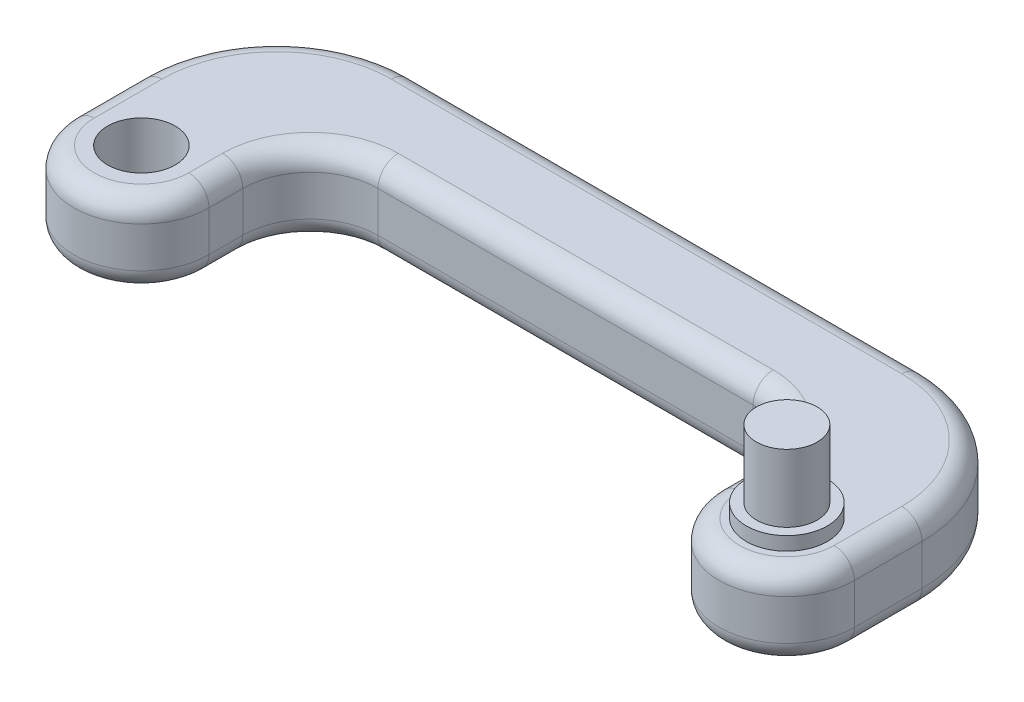
ISO-10303-21;
HEADER;
FILE_DESCRIPTION(('STEP AP214'),'2;1');
FILE_NAME('part.step','',(''),(''),'','','');
FILE_SCHEMA(('AUTOMOTIVE_DESIGN { 1 0 10303 214 1 1 1 1 }'));
ENDSEC;
DATA;
#1=APPLICATION_CONTEXT('core data for automotive mechanical design processes');
#2=APPLICATION_PROTOCOL_DEFINITION('international standard','automotive_design',2000,#1);
#3=PRODUCT_CONTEXT('',#1,'mechanical');
#4=PRODUCT('Part','Part','',(#3));
#5=PRODUCT_RELATED_PRODUCT_CATEGORY('part','',(#4));
#6=PRODUCT_DEFINITION_FORMATION('','',#4);
#7=PRODUCT_DEFINITION_CONTEXT('part definition',#1,'design');
#8=PRODUCT_DEFINITION('design','',#6,#7);
#9=PRODUCT_DEFINITION_SHAPE('','',#8);
#10=(LENGTH_UNIT() NAMED_UNIT(*) SI_UNIT(.MILLI.,.METRE.));
#11=(NAMED_UNIT(*) PLANE_ANGLE_UNIT() SI_UNIT($,.RADIAN.));
#12=(NAMED_UNIT(*) SI_UNIT($,.STERADIAN.) SOLID_ANGLE_UNIT());
#13=UNCERTAINTY_MEASURE_WITH_UNIT(LENGTH_MEASURE(1.E-05),#10,'distance_accuracy_value','');
#14=(GEOMETRIC_REPRESENTATION_CONTEXT(3) GLOBAL_UNCERTAINTY_ASSIGNED_CONTEXT((#13)) GLOBAL_UNIT_ASSIGNED_CONTEXT((#10,
#11,#12)) REPRESENTATION_CONTEXT('',''));
#15=CARTESIAN_POINT('',(0.,0.,0.));
#16=DIRECTION('',(0.,0.,1.));
#17=DIRECTION('',(1.,0.,0.));
#18=AXIS2_PLACEMENT_3D('',#15,#16,#17);
#19=CARTESIAN_POINT('',(-105.5,12.,0.));
#20=DIRECTION('',(-1.,0.,0.));
#21=DIRECTION('',(0.,0.,1.));
#22=AXIS2_PLACEMENT_3D('',#19,#20,#21);
#23=PLANE('',#22);
#24=DIRECTION('',(0.,-1.,0.));
#25=VECTOR('',#24,1.);
#26=CARTESIAN_POINT('',(-105.5,12.,0.));
#27=LINE('',#26,#25);
#28=CARTESIAN_POINT('',(-105.5,9.,0.));
#29=VERTEX_POINT('',#28);
#30=CARTESIAN_POINT('',(-105.5,3.,0.));
#31=VERTEX_POINT('',#30);
#32=EDGE_CURVE('E431',#29,#31,#27,.T.);
#33=ORIENTED_EDGE('',*,*,#32,.F.);
#34=DIRECTION('',(0.,0.,-1.));
#35=VECTOR('',#34,1.);
#36=CARTESIAN_POINT('',(-105.5,9.,0.));
#37=LINE('',#36,#35);
#38=CARTESIAN_POINT('',(-105.5,9.,-10.));
#39=VERTEX_POINT('',#38);
#40=EDGE_CURVE('E317',#29,#39,#37,.T.);
#41=ORIENTED_EDGE('',*,*,#40,.T.);
#42=DIRECTION('',(0.,-1.,0.));
#43=VECTOR('',#42,1.);
#44=CARTESIAN_POINT('',(-105.5,12.,-10.));
#45=LINE('',#44,#43);
#46=CARTESIAN_POINT('',(-105.5,3.,-10.));
#47=VERTEX_POINT('',#46);
#48=EDGE_CURVE('E239',#39,#47,#45,.T.);
#49=ORIENTED_EDGE('',*,*,#48,.T.);
#50=DIRECTION('',(0.,0.,-1.));
#51=VECTOR('',#50,1.);
#52=CARTESIAN_POINT('',(-105.5,3.,0.));
#53=LINE('',#52,#51);
#54=EDGE_CURVE('E314',#47,#31,#53,.F.);
#55=ORIENTED_EDGE('',*,*,#54,.T.);
#56=EDGE_LOOP('',(#33,#41,#49,#55));
#57=FACE_BOUND('',#56,.T.);
#58=ADVANCED_FACE('F37',(#57),#23,.T.);
#59=CARTESIAN_POINT('',(-95.5,12.,0.));
#60=DIRECTION('',(0.,-1.,0.));
#61=DIRECTION('',(0.,0.,-1.));
#62=AXIS2_PLACEMENT_3D('',#59,#60,#61);
#63=CYLINDRICAL_SURFACE('',#62,9.99999999999999);
#64=DIRECTION('',(0.,-1.,0.));
#65=VECTOR('',#64,1.);
#66=CARTESIAN_POINT('',(-85.5,12.,0.));
#67=LINE('',#66,#65);
#68=CARTESIAN_POINT('',(-85.5,9.,0.));
#69=VERTEX_POINT('',#68);
#70=CARTESIAN_POINT('',(-85.5,3.,0.));
#71=VERTEX_POINT('',#70);
#72=EDGE_CURVE('E427',#69,#71,#67,.T.);
#73=ORIENTED_EDGE('',*,*,#72,.F.);
#74=CARTESIAN_POINT('',(-95.5,9.,0.));
#75=DIRECTION('',(0.,1.,0.));
#76=DIRECTION('',(0.,0.,1.));
#77=AXIS2_PLACEMENT_3D('',#74,#75,#76);
#78=CIRCLE('',#77,9.99999999999999);
#79=EDGE_CURVE('E312',#69,#29,#78,.F.);
#80=ORIENTED_EDGE('',*,*,#79,.T.);
#81=ORIENTED_EDGE('',*,*,#32,.T.);
#82=CARTESIAN_POINT('',(-95.5,3.,0.));
#83=DIRECTION('',(0.,1.,0.));
#84=DIRECTION('',(0.,0.,1.));
#85=AXIS2_PLACEMENT_3D('',#82,#83,#84);
#86=CIRCLE('',#85,9.99999999999999);
#87=EDGE_CURVE('E310',#31,#71,#86,.T.);
#88=ORIENTED_EDGE('',*,*,#87,.T.);
#89=EDGE_LOOP('',(#73,#80,#81,#88));
#90=FACE_BOUND('',#89,.T.);
#91=ADVANCED_FACE('F474',(#90),#63,.T.);
#92=CARTESIAN_POINT('',(-85.5,12.,0.));
#93=DIRECTION('',(-1.,0.,0.));
#94=DIRECTION('',(0.,0.,1.));
#95=AXIS2_PLACEMENT_3D('',#92,#93,#94);
#96=PLANE('',#95);
#97=DIRECTION('',(0.,-1.,0.));
#98=VECTOR('',#97,1.);
#99=CARTESIAN_POINT('',(-85.5,12.,-5.));
#100=LINE('',#99,#98);
#101=CARTESIAN_POINT('',(-85.5,3.,-5.));
#102=VERTEX_POINT('',#101);
#103=CARTESIAN_POINT('',(-85.5,9.,-5.));
#104=VERTEX_POINT('',#103);
#105=EDGE_CURVE('E256',#102,#104,#100,.F.);
#106=ORIENTED_EDGE('',*,*,#105,.T.);
#107=DIRECTION('',(0.,0.,-1.));
#108=VECTOR('',#107,1.);
#109=CARTESIAN_POINT('',(-85.5,9.,0.));
#110=LINE('',#109,#108);
#111=EDGE_CURVE('E308',#104,#69,#110,.F.);
#112=ORIENTED_EDGE('',*,*,#111,.T.);
#113=ORIENTED_EDGE('',*,*,#72,.T.);
#114=DIRECTION('',(0.,0.,-1.));
#115=VECTOR('',#114,1.);
#116=CARTESIAN_POINT('',(-85.5,3.,0.));
#117=LINE('',#116,#115);
#118=EDGE_CURVE('E306',#71,#102,#117,.T.);
#119=ORIENTED_EDGE('',*,*,#118,.T.);
#120=EDGE_LOOP('',(#106,#112,#113,#119));
#121=FACE_BOUND('',#120,.T.);
#122=ADVANCED_FACE('F479',(#121),#96,.F.);
#123=CARTESIAN_POINT('',(0.,12.,-15.));
#124=DIRECTION('',(0.,0.,-1.));
#125=DIRECTION('',(-1.,0.,0.));
#126=AXIS2_PLACEMENT_3D('',#123,#124,#125);
#127=PLANE('',#126);
#128=DIRECTION('',(0.,-1.,0.));
#129=VECTOR('',#128,1.);
#130=CARTESIAN_POINT('',(-19.9999999999614,12.,-15.));
#131=LINE('',#130,#129);
#132=CARTESIAN_POINT('',(-19.9999999999614,3.,-15.));
#133=VERTEX_POINT('',#132);
#134=CARTESIAN_POINT('',(-19.9999999999614,9.,-15.));
#135=VERTEX_POINT('',#134);
#136=EDGE_CURVE('E253',#133,#135,#131,.F.);
#137=ORIENTED_EDGE('',*,*,#136,.T.);
#138=DIRECTION('',(1.,0.,0.));
#139=VECTOR('',#138,1.);
#140=CARTESIAN_POINT('',(-75.5,9.,-15.));
#141=LINE('',#140,#139);
#142=CARTESIAN_POINT('',(-75.5,9.,-15.));
#143=VERTEX_POINT('',#142);
#144=EDGE_CURVE('E300',#135,#143,#141,.F.);
#145=ORIENTED_EDGE('',*,*,#144,.T.);
#146=DIRECTION('',(0.,-1.,0.));
#147=VECTOR('',#146,1.);
#148=CARTESIAN_POINT('',(-75.5,0.,-15.));
#149=LINE('',#148,#147);
#150=CARTESIAN_POINT('',(-75.5,3.,-15.));
#151=VERTEX_POINT('',#150);
#152=EDGE_CURVE('E250',#143,#151,#149,.T.);
#153=ORIENTED_EDGE('',*,*,#152,.T.);
#154=DIRECTION('',(1.,0.,0.));
#155=VECTOR('',#154,1.);
#156=CARTESIAN_POINT('',(0.,3.,-15.));
#157=LINE('',#156,#155);
#158=EDGE_CURVE('E298',#151,#133,#157,.T.);
#159=ORIENTED_EDGE('',*,*,#158,.T.);
#160=EDGE_LOOP('',(#137,#145,#153,#159));
#161=FACE_BOUND('',#160,.T.);
#162=ADVANCED_FACE('F484',(#161),#127,.F.);
#163=CARTESIAN_POINT('',(-9.99999999996144,12.,0.));
#164=DIRECTION('',(-1.,0.,0.));
#165=DIRECTION('',(0.,0.,1.));
#166=AXIS2_PLACEMENT_3D('',#163,#164,#165);
#167=PLANE('',#166);
#168=DIRECTION('',(0.,-1.,0.));
#169=VECTOR('',#168,1.);
#170=CARTESIAN_POINT('',(-9.99999999996144,12.,0.));
#171=LINE('',#170,#169);
#172=CARTESIAN_POINT('',(-9.99999999996144,9.,0.));
#173=VERTEX_POINT('',#172);
#174=CARTESIAN_POINT('',(-9.99999999996144,3.,0.));
#175=VERTEX_POINT('',#174);
#176=EDGE_CURVE('E419',#173,#175,#171,.T.);
#177=ORIENTED_EDGE('',*,*,#176,.F.);
#178=DIRECTION('',(0.,0.,-1.));
#179=VECTOR('',#178,1.);
#180=CARTESIAN_POINT('',(-9.99999999996144,9.,0.));
#181=LINE('',#180,#179);
#182=CARTESIAN_POINT('',(-9.99999999996144,9.,-5.));
#183=VERTEX_POINT('',#182);
#184=EDGE_CURVE('E292',#173,#183,#181,.T.);
#185=ORIENTED_EDGE('',*,*,#184,.T.);
#186=DIRECTION('',(0.,-1.,0.));
#187=VECTOR('',#186,1.);
#188=CARTESIAN_POINT('',(-9.99999999996144,12.,-5.));
#189=LINE('',#188,#187);
#190=CARTESIAN_POINT('',(-9.99999999996144,3.,-5.));
#191=VERTEX_POINT('',#190);
#192=EDGE_CURVE('E247',#183,#191,#189,.T.);
#193=ORIENTED_EDGE('',*,*,#192,.T.);
#194=DIRECTION('',(0.,0.,-1.));
#195=VECTOR('',#194,1.);
#196=CARTESIAN_POINT('',(-9.99999999996144,3.,0.));
#197=LINE('',#196,#195);
#198=EDGE_CURVE('E290',#191,#175,#197,.F.);
#199=ORIENTED_EDGE('',*,*,#198,.T.);
#200=EDGE_LOOP('',(#177,#185,#193,#199));
#201=FACE_BOUND('',#200,.T.);
#202=ADVANCED_FACE('F418',(#201),#167,.T.);
#203=CARTESIAN_POINT('',(0.,12.,0.));
#204=DIRECTION('',(0.,-1.,0.));
#205=DIRECTION('',(0.,0.,-1.));
#206=AXIS2_PLACEMENT_3D('',#203,#204,#205);
#207=CYLINDRICAL_SURFACE('',#206,9.99999999996144);
#208=DIRECTION('',(0.,-1.,0.));
#209=VECTOR('',#208,1.);
#210=CARTESIAN_POINT('',(9.99999999996144,12.,0.));
#211=LINE('',#210,#209);
#212=CARTESIAN_POINT('',(9.99999999996144,9.,0.));
#213=VERTEX_POINT('',#212);
#214=CARTESIAN_POINT('',(9.99999999996144,3.,0.));
#215=VERTEX_POINT('',#214);
#216=EDGE_CURVE('E428',#213,#215,#211,.T.);
#217=ORIENTED_EDGE('',*,*,#216,.F.);
#218=CARTESIAN_POINT('',(0.,9.,0.));
#219=DIRECTION('',(0.,1.,0.));
#220=DIRECTION('',(0.,0.,1.));
#221=AXIS2_PLACEMENT_3D('',#218,#219,#220);
#222=CIRCLE('',#221,9.99999999996144);
#223=EDGE_CURVE('E288',#213,#173,#222,.F.);
#224=ORIENTED_EDGE('',*,*,#223,.T.);
#225=ORIENTED_EDGE('',*,*,#176,.T.);
#226=CARTESIAN_POINT('',(0.,3.,0.));
#227=DIRECTION('',(0.,1.,0.));
#228=DIRECTION('',(0.,0.,1.));
#229=AXIS2_PLACEMENT_3D('',#226,#227,#228);
#230=CIRCLE('',#229,9.99999999996144);
#231=EDGE_CURVE('E286',#175,#215,#230,.T.);
#232=ORIENTED_EDGE('',*,*,#231,.T.);
#233=EDGE_LOOP('',(#217,#224,#225,#232));
#234=FACE_BOUND('',#233,.T.);
#235=ADVANCED_FACE('F424',(#234),#207,.T.);
#236=CARTESIAN_POINT('',(9.99999999996144,12.,0.));
#237=DIRECTION('',(-1.,0.,0.));
#238=DIRECTION('',(0.,0.,1.));
#239=AXIS2_PLACEMENT_3D('',#236,#237,#238);
#240=PLANE('',#239);
#241=DIRECTION('',(0.,-1.,0.));
#242=VECTOR('',#241,1.);
#243=CARTESIAN_POINT('',(9.99999999996144,12.,-10.));
#244=LINE('',#243,#242);
#245=CARTESIAN_POINT('',(9.99999999996144,3.,-10.));
#246=VERTEX_POINT('',#245);
#247=CARTESIAN_POINT('',(9.99999999996144,9.,-10.));
#248=VERTEX_POINT('',#247);
#249=EDGE_CURVE('E237',#246,#248,#244,.F.);
#250=ORIENTED_EDGE('',*,*,#249,.T.);
#251=DIRECTION('',(0.,0.,-1.));
#252=VECTOR('',#251,1.);
#253=CARTESIAN_POINT('',(9.99999999996144,9.,0.));
#254=LINE('',#253,#252);
#255=EDGE_CURVE('E284',#248,#213,#254,.F.);
#256=ORIENTED_EDGE('',*,*,#255,.T.);
#257=ORIENTED_EDGE('',*,*,#216,.T.);
#258=DIRECTION('',(0.,0.,-1.));
#259=VECTOR('',#258,1.);
#260=CARTESIAN_POINT('',(9.99999999996144,3.,0.));
#261=LINE('',#260,#259);
#262=EDGE_CURVE('E220',#215,#246,#261,.T.);
#263=ORIENTED_EDGE('',*,*,#262,.T.);
#264=EDGE_LOOP('',(#250,#256,#257,#263));
#265=FACE_BOUND('',#264,.T.);
#266=ADVANCED_FACE('F460',(#265),#240,.F.);
#267=CARTESIAN_POINT('',(-95.5,12.,0.));
#268=DIRECTION('',(0.,-1.,0.));
#269=DIRECTION('',(0.,0.,-1.));
#270=AXIS2_PLACEMENT_3D('',#267,#268,#269);
#271=CYLINDRICAL_SURFACE('',#270,5.);
#272=CARTESIAN_POINT('',(-95.5,12.,0.));
#273=DIRECTION('',(0.,1.,0.));
#274=DIRECTION('',(0.,0.,1.));
#275=AXIS2_PLACEMENT_3D('',#272,#273,#274);
#276=CIRCLE('',#275,5.);
#277=CARTESIAN_POINT('',(-95.5,12.,5.00000000000002));
#278=VERTEX_POINT('',#277);
#279=EDGE_CURVE('E433',#278,#278,#276,.T.);
#280=ORIENTED_EDGE('',*,*,#279,.T.);
#281=EDGE_LOOP('',(#280));
#282=FACE_BOUND('',#281,.T.);
#283=CARTESIAN_POINT('',(-95.5,0.,0.));
#284=DIRECTION('',(0.,1.,0.));
#285=DIRECTION('',(0.,0.,1.));
#286=AXIS2_PLACEMENT_3D('',#283,#284,#285);
#287=CIRCLE('',#286,5.);
#288=CARTESIAN_POINT('',(-95.5,0.,5.00000000000002));
#289=VERTEX_POINT('',#288);
#290=EDGE_CURVE('E448',#289,#289,#287,.T.);
#291=ORIENTED_EDGE('',*,*,#290,.F.);
#292=EDGE_LOOP('',(#291));
#293=FACE_BOUND('',#292,.T.);
#294=ADVANCED_FACE('F458',(#282,#293),#271,.F.);
#295=CARTESIAN_POINT('',(0.,12.,-30.));
#296=DIRECTION('',(0.,0.,-1.));
#297=DIRECTION('',(-1.,0.,0.));
#298=AXIS2_PLACEMENT_3D('',#295,#296,#297);
#299=PLANE('',#298);
#300=DIRECTION('',(0.,-1.,0.));
#301=VECTOR('',#300,1.);
#302=CARTESIAN_POINT('',(-85.5,12.,-30.));
#303=LINE('',#302,#301);
#304=CARTESIAN_POINT('',(-85.5,3.,-30.));
#305=VERTEX_POINT('',#304);
#306=CARTESIAN_POINT('',(-85.5,9.,-30.));
#307=VERTEX_POINT('',#306);
#308=EDGE_CURVE('E230',#305,#307,#303,.F.);
#309=ORIENTED_EDGE('',*,*,#308,.T.);
#310=DIRECTION('',(1.,0.,0.));
#311=VECTOR('',#310,1.);
#312=CARTESIAN_POINT('',(0.,9.,-30.));
#313=LINE('',#312,#311);
#314=CARTESIAN_POINT('',(-10.0000000000386,9.,-30.));
#315=VERTEX_POINT('',#314);
#316=EDGE_CURVE('E204',#307,#315,#313,.T.);
#317=ORIENTED_EDGE('',*,*,#316,.T.);
#318=DIRECTION('',(0.,-1.,0.));
#319=VECTOR('',#318,1.);
#320=CARTESIAN_POINT('',(-10.0000000000386,0.,-30.));
#321=LINE('',#320,#319);
#322=CARTESIAN_POINT('',(-10.0000000000386,3.,-30.));
#323=VERTEX_POINT('',#322);
#324=EDGE_CURVE('E227',#315,#323,#321,.T.);
#325=ORIENTED_EDGE('',*,*,#324,.T.);
#326=DIRECTION('',(1.,0.,0.));
#327=VECTOR('',#326,1.);
#328=CARTESIAN_POINT('',(-85.5,3.,-30.));
#329=LINE('',#328,#327);
#330=EDGE_CURVE('E233',#323,#305,#329,.F.);
#331=ORIENTED_EDGE('',*,*,#330,.T.);
#332=EDGE_LOOP('',(#309,#317,#325,#331));
#333=FACE_BOUND('',#332,.T.);
#334=ADVANCED_FACE('F226',(#333),#299,.T.);
#335=CARTESIAN_POINT('',(0.,12.,0.));
#336=DIRECTION('',(0.,1.,0.));
#337=DIRECTION('',(0.,0.,1.));
#338=AXIS2_PLACEMENT_3D('',#335,#336,#337);
#339=PLANE('',#338);
#340=CARTESIAN_POINT('',(-10.0000000000386,12.,-10.));
#341=DIRECTION('',(0.,1.,0.));
#342=DIRECTION('',(0.,0.,1.));
#343=AXIS2_PLACEMENT_3D('',#340,#341,#342);
#344=CIRCLE('',#343,17.);
#345=CARTESIAN_POINT('',(6.99999999996144,12.,-10.));
#346=VERTEX_POINT('',#345);
#347=CARTESIAN_POINT('',(-10.0000000000386,12.,-27.));
#348=VERTEX_POINT('',#347);
#349=EDGE_CURVE('E279',#346,#348,#344,.T.);
#350=ORIENTED_EDGE('',*,*,#349,.T.);
#351=DIRECTION('',(1.,0.,0.));
#352=VECTOR('',#351,1.);
#353=CARTESIAN_POINT('',(0.,12.,-27.));
#354=LINE('',#353,#352);
#355=CARTESIAN_POINT('',(-85.5,12.,-27.));
#356=VERTEX_POINT('',#355);
#357=EDGE_CURVE('E206',#348,#356,#354,.F.);
#358=ORIENTED_EDGE('',*,*,#357,.T.);
#359=CARTESIAN_POINT('',(-85.5,12.,-10.));
#360=DIRECTION('',(0.,1.,0.));
#361=DIRECTION('',(0.,0.,1.));
#362=AXIS2_PLACEMENT_3D('',#359,#360,#361);
#363=CIRCLE('',#362,17.);
#364=CARTESIAN_POINT('',(-102.5,12.,-10.));
#365=VERTEX_POINT('',#364);
#366=EDGE_CURVE('E232',#356,#365,#363,.T.);
#367=ORIENTED_EDGE('',*,*,#366,.T.);
#368=DIRECTION('',(0.,0.,-1.));
#369=VECTOR('',#368,1.);
#370=CARTESIAN_POINT('',(-102.5,12.,0.));
#371=LINE('',#370,#369);
#372=CARTESIAN_POINT('',(-102.5,12.,0.));
#373=VERTEX_POINT('',#372);
#374=EDGE_CURVE('E261',#365,#373,#371,.F.);
#375=ORIENTED_EDGE('',*,*,#374,.T.);
#376=CARTESIAN_POINT('',(-95.5,12.,0.));
#377=DIRECTION('',(0.,1.,0.));
#378=DIRECTION('',(0.,0.,1.));
#379=AXIS2_PLACEMENT_3D('',#376,#377,#378);
#380=CIRCLE('',#379,6.99999999999999);
#381=CARTESIAN_POINT('',(-88.5,12.,0.));
#382=VERTEX_POINT('',#381);
#383=EDGE_CURVE('E263',#373,#382,#380,.T.);
#384=ORIENTED_EDGE('',*,*,#383,.T.);
#385=DIRECTION('',(0.,0.,-1.));
#386=VECTOR('',#385,1.);
#387=CARTESIAN_POINT('',(-88.5,12.,-5.));
#388=LINE('',#387,#386);
#389=CARTESIAN_POINT('',(-88.5,12.,-5.));
#390=VERTEX_POINT('',#389);
#391=EDGE_CURVE('E265',#382,#390,#388,.T.);
#392=ORIENTED_EDGE('',*,*,#391,.T.);
#393=CARTESIAN_POINT('',(-75.5,12.,-5.));
#394=DIRECTION('',(0.,1.,0.));
#395=DIRECTION('',(0.,0.,1.));
#396=AXIS2_PLACEMENT_3D('',#393,#394,#395);
#397=CIRCLE('',#396,13.);
#398=CARTESIAN_POINT('',(-75.5,12.,-18.));
#399=VERTEX_POINT('',#398);
#400=EDGE_CURVE('E267',#390,#399,#397,.F.);
#401=ORIENTED_EDGE('',*,*,#400,.T.);
#402=DIRECTION('',(1.,0.,0.));
#403=VECTOR('',#402,1.);
#404=CARTESIAN_POINT('',(-19.9999999999614,12.,-18.));
#405=LINE('',#404,#403);
#406=CARTESIAN_POINT('',(-19.9999999999614,12.,-18.));
#407=VERTEX_POINT('',#406);
#408=EDGE_CURVE('E269',#399,#407,#405,.T.);
#409=ORIENTED_EDGE('',*,*,#408,.T.);
#410=CARTESIAN_POINT('',(-19.9999999999614,12.,-5.));
#411=DIRECTION('',(0.,1.,0.));
#412=DIRECTION('',(0.,0.,1.));
#413=AXIS2_PLACEMENT_3D('',#410,#411,#412);
#414=CIRCLE('',#413,13.);
#415=CARTESIAN_POINT('',(-6.99999999996144,12.,-5.));
#416=VERTEX_POINT('',#415);
#417=EDGE_CURVE('E271',#407,#416,#414,.F.);
#418=ORIENTED_EDGE('',*,*,#417,.T.);
#419=DIRECTION('',(0.,0.,-1.));
#420=VECTOR('',#419,1.);
#421=CARTESIAN_POINT('',(-6.99999999996144,12.,0.));
#422=LINE('',#421,#420);
#423=CARTESIAN_POINT('',(-6.99999999996144,12.,0.));
#424=VERTEX_POINT('',#423);
#425=EDGE_CURVE('E273',#416,#424,#422,.F.);
#426=ORIENTED_EDGE('',*,*,#425,.T.);
#427=CARTESIAN_POINT('',(0.,12.,0.));
#428=DIRECTION('',(0.,1.,0.));
#429=DIRECTION('',(0.,0.,1.));
#430=AXIS2_PLACEMENT_3D('',#427,#428,#429);
#431=CIRCLE('',#430,6.99999999996144);
#432=CARTESIAN_POINT('',(6.99999999996144,12.,0.));
#433=VERTEX_POINT('',#432);
#434=EDGE_CURVE('E275',#424,#433,#431,.T.);
#435=ORIENTED_EDGE('',*,*,#434,.T.);
#436=DIRECTION('',(0.,0.,-1.));
#437=VECTOR('',#436,1.);
#438=CARTESIAN_POINT('',(6.99999999996144,12.,-10.));
#439=LINE('',#438,#437);
#440=EDGE_CURVE('E277',#433,#346,#439,.T.);
#441=ORIENTED_EDGE('',*,*,#440,.T.);
#442=EDGE_LOOP('',(#350,#358,#367,#375,#384,#392,#401,#409,#418,#426,#435,#441));
#443=FACE_BOUND('',#442,.T.);
#444=CARTESIAN_POINT('',(0.,12.,0.));
#445=DIRECTION('',(0.,1.,0.));
#446=DIRECTION('',(0.,0.,1.));
#447=AXIS2_PLACEMENT_3D('',#444,#445,#446);
#448=CIRCLE('',#447,6.);
#449=CARTESIAN_POINT('',(0.,12.,6.));
#450=VERTEX_POINT('',#449);
#451=EDGE_CURVE('E449',#450,#450,#448,.T.);
#452=ORIENTED_EDGE('',*,*,#451,.F.);
#453=EDGE_LOOP('',(#452));
#454=FACE_BOUND('',#453,.T.);
#455=ORIENTED_EDGE('',*,*,#279,.F.);
#456=EDGE_LOOP('',(#455));
#457=FACE_BOUND('',#456,.T.);
#458=ADVANCED_FACE('F467',(#443,#454,#457),#339,.T.);
#459=CARTESIAN_POINT('',(0.,0.,0.));
#460=DIRECTION('',(0.,1.,0.));
#461=DIRECTION('',(0.,0.,1.));
#462=AXIS2_PLACEMENT_3D('',#459,#460,#461);
#463=PLANE('',#462);
#464=CARTESIAN_POINT('',(-95.5,0.,0.));
#465=DIRECTION('',(0.,1.,0.));
#466=DIRECTION('',(0.,0.,1.));
#467=AXIS2_PLACEMENT_3D('',#464,#465,#466);
#468=CIRCLE('',#467,6.99999999999999);
#469=CARTESIAN_POINT('',(-88.5,0.,0.));
#470=VERTEX_POINT('',#469);
#471=CARTESIAN_POINT('',(-102.5,0.,0.));
#472=VERTEX_POINT('',#471);
#473=EDGE_CURVE('E54',#470,#472,#468,.F.);
#474=ORIENTED_EDGE('',*,*,#473,.T.);
#475=DIRECTION('',(0.,0.,-1.));
#476=VECTOR('',#475,1.);
#477=CARTESIAN_POINT('',(-102.5,0.,-10.));
#478=LINE('',#477,#476);
#479=CARTESIAN_POINT('',(-102.5,0.,-10.));
#480=VERTEX_POINT('',#479);
#481=EDGE_CURVE('E339',#472,#480,#478,.T.);
#482=ORIENTED_EDGE('',*,*,#481,.T.);
#483=CARTESIAN_POINT('',(-85.5,0.,-10.));
#484=DIRECTION('',(0.,1.,0.));
#485=DIRECTION('',(0.,0.,1.));
#486=AXIS2_PLACEMENT_3D('',#483,#484,#485);
#487=CIRCLE('',#486,17.);
#488=CARTESIAN_POINT('',(-85.5,0.,-27.));
#489=VERTEX_POINT('',#488);
#490=EDGE_CURVE('E319',#480,#489,#487,.F.);
#491=ORIENTED_EDGE('',*,*,#490,.T.);
#492=DIRECTION('',(1.,0.,0.));
#493=VECTOR('',#492,1.);
#494=CARTESIAN_POINT('',(-10.0000000000386,0.,-27.));
#495=LINE('',#494,#493);
#496=CARTESIAN_POINT('',(-10.0000000000386,0.,-27.));
#497=VERTEX_POINT('',#496);
#498=EDGE_CURVE('E321',#489,#497,#495,.T.);
#499=ORIENTED_EDGE('',*,*,#498,.T.);
#500=CARTESIAN_POINT('',(-10.0000000000386,0.,-10.));
#501=DIRECTION('',(0.,1.,0.));
#502=DIRECTION('',(0.,0.,1.));
#503=AXIS2_PLACEMENT_3D('',#500,#501,#502);
#504=CIRCLE('',#503,17.);
#505=CARTESIAN_POINT('',(6.99999999996144,0.,-10.));
#506=VERTEX_POINT('',#505);
#507=EDGE_CURVE('E323',#497,#506,#504,.F.);
#508=ORIENTED_EDGE('',*,*,#507,.T.);
#509=DIRECTION('',(0.,0.,-1.));
#510=VECTOR('',#509,1.);
#511=CARTESIAN_POINT('',(6.99999999996144,0.,0.));
#512=LINE('',#511,#510);
#513=CARTESIAN_POINT('',(6.99999999996144,0.,0.));
#514=VERTEX_POINT('',#513);
#515=EDGE_CURVE('E325',#506,#514,#512,.F.);
#516=ORIENTED_EDGE('',*,*,#515,.T.);
#517=CARTESIAN_POINT('',(0.,0.,0.));
#518=DIRECTION('',(0.,1.,0.));
#519=DIRECTION('',(0.,0.,1.));
#520=AXIS2_PLACEMENT_3D('',#517,#518,#519);
#521=CIRCLE('',#520,6.99999999996144);
#522=CARTESIAN_POINT('',(-6.99999999996144,0.,0.));
#523=VERTEX_POINT('',#522);
#524=EDGE_CURVE('E327',#514,#523,#521,.F.);
#525=ORIENTED_EDGE('',*,*,#524,.T.);
#526=DIRECTION('',(0.,0.,-1.));
#527=VECTOR('',#526,1.);
#528=CARTESIAN_POINT('',(-6.99999999996144,0.,-5.));
#529=LINE('',#528,#527);
#530=CARTESIAN_POINT('',(-6.99999999996144,0.,-5.));
#531=VERTEX_POINT('',#530);
#532=EDGE_CURVE('E329',#523,#531,#529,.T.);
#533=ORIENTED_EDGE('',*,*,#532,.T.);
#534=CARTESIAN_POINT('',(-19.9999999999614,0.,-5.));
#535=DIRECTION('',(0.,1.,0.));
#536=DIRECTION('',(0.,0.,1.));
#537=AXIS2_PLACEMENT_3D('',#534,#535,#536);
#538=CIRCLE('',#537,13.);
#539=CARTESIAN_POINT('',(-19.9999999999614,0.,-18.));
#540=VERTEX_POINT('',#539);
#541=EDGE_CURVE('E331',#531,#540,#538,.T.);
#542=ORIENTED_EDGE('',*,*,#541,.T.);
#543=DIRECTION('',(1.,0.,0.));
#544=VECTOR('',#543,1.);
#545=CARTESIAN_POINT('',(0.,0.,-18.));
#546=LINE('',#545,#544);
#547=CARTESIAN_POINT('',(-75.5,0.,-18.));
#548=VERTEX_POINT('',#547);
#549=EDGE_CURVE('E333',#540,#548,#546,.F.);
#550=ORIENTED_EDGE('',*,*,#549,.T.);
#551=CARTESIAN_POINT('',(-75.5,0.,-5.));
#552=DIRECTION('',(0.,1.,0.));
#553=DIRECTION('',(0.,0.,1.));
#554=AXIS2_PLACEMENT_3D('',#551,#552,#553);
#555=CIRCLE('',#554,13.);
#556=CARTESIAN_POINT('',(-88.5,0.,-5.));
#557=VERTEX_POINT('',#556);
#558=EDGE_CURVE('E335',#548,#557,#555,.T.);
#559=ORIENTED_EDGE('',*,*,#558,.T.);
#560=DIRECTION('',(0.,0.,-1.));
#561=VECTOR('',#560,1.);
#562=CARTESIAN_POINT('',(-88.5,0.,0.));
#563=LINE('',#562,#561);
#564=EDGE_CURVE('E59',#557,#470,#563,.F.);
#565=ORIENTED_EDGE('',*,*,#564,.T.);
#566=EDGE_LOOP('',(#474,#482,#491,#499,#508,#516,#525,#533,#542,#550,#559,#565));
#567=FACE_BOUND('',#566,.T.);
#568=ORIENTED_EDGE('',*,*,#290,.T.);
#569=EDGE_LOOP('',(#568));
#570=FACE_BOUND('',#569,.T.);
#571=ADVANCED_FACE('F456',(#567,#570),#463,.F.);
#572=CARTESIAN_POINT('',(0.,14.,0.));
#573=DIRECTION('',(0.,-1.,0.));
#574=DIRECTION('',(0.,0.,-1.));
#575=AXIS2_PLACEMENT_3D('',#572,#573,#574);
#576=CYLINDRICAL_SURFACE('',#575,6.);
#577=CARTESIAN_POINT('',(0.,14.,0.));
#578=DIRECTION('',(0.,1.,0.));
#579=DIRECTION('',(0.,0.,1.));
#580=AXIS2_PLACEMENT_3D('',#577,#578,#579);
#581=CIRCLE('',#580,6.);
#582=CARTESIAN_POINT('',(0.,14.,6.));
#583=VERTEX_POINT('',#582);
#584=EDGE_CURVE('E445',#583,#583,#581,.T.);
#585=ORIENTED_EDGE('',*,*,#584,.F.);
#586=EDGE_LOOP('',(#585));
#587=FACE_BOUND('',#586,.T.);
#588=ORIENTED_EDGE('',*,*,#451,.T.);
#589=EDGE_LOOP('',(#588));
#590=FACE_BOUND('',#589,.T.);
#591=ADVANCED_FACE('F495',(#587,#590),#576,.T.);
#592=CARTESIAN_POINT('',(0.,14.,0.));
#593=DIRECTION('',(0.,1.,0.));
#594=DIRECTION('',(0.,0.,1.));
#595=AXIS2_PLACEMENT_3D('',#592,#593,#594);
#596=PLANE('',#595);
#597=CARTESIAN_POINT('',(0.,14.,0.));
#598=DIRECTION('',(0.,1.,0.));
#599=DIRECTION('',(0.,0.,1.));
#600=AXIS2_PLACEMENT_3D('',#597,#598,#599);
#601=CIRCLE('',#600,4.5);
#602=CARTESIAN_POINT('',(0.,14.,4.5));
#603=VERTEX_POINT('',#602);
#604=EDGE_CURVE('E241',#603,#603,#601,.T.);
#605=ORIENTED_EDGE('',*,*,#604,.F.);
#606=EDGE_LOOP('',(#605));
#607=FACE_BOUND('',#606,.T.);
#608=ORIENTED_EDGE('',*,*,#584,.T.);
#609=EDGE_LOOP('',(#608));
#610=FACE_BOUND('',#609,.T.);
#611=ADVANCED_FACE('F501',(#607,#610),#596,.T.);
#612=CARTESIAN_POINT('',(0.,24.,0.));
#613=DIRECTION('',(0.,-1.,0.));
#614=DIRECTION('',(0.,0.,-1.));
#615=AXIS2_PLACEMENT_3D('',#612,#613,#614);
#616=CYLINDRICAL_SURFACE('',#615,4.5);
#617=CARTESIAN_POINT('',(0.,24.,0.));
#618=DIRECTION('',(0.,1.,0.));
#619=DIRECTION('',(0.,0.,1.));
#620=AXIS2_PLACEMENT_3D('',#617,#618,#619);
#621=CIRCLE('',#620,4.5);
#622=CARTESIAN_POINT('',(0.,24.,4.5));
#623=VERTEX_POINT('',#622);
#624=EDGE_CURVE('E371',#623,#623,#621,.T.);
#625=ORIENTED_EDGE('',*,*,#624,.F.);
#626=EDGE_LOOP('',(#625));
#627=FACE_BOUND('',#626,.T.);
#628=ORIENTED_EDGE('',*,*,#604,.T.);
#629=EDGE_LOOP('',(#628));
#630=FACE_BOUND('',#629,.T.);
#631=ADVANCED_FACE('F505',(#627,#630),#616,.T.);
#632=CARTESIAN_POINT('',(0.,24.,0.));
#633=DIRECTION('',(0.,1.,0.));
#634=DIRECTION('',(0.,0.,1.));
#635=AXIS2_PLACEMENT_3D('',#632,#633,#634);
#636=PLANE('',#635);
#637=ORIENTED_EDGE('',*,*,#624,.T.);
#638=EDGE_LOOP('',(#637));
#639=FACE_BOUND('',#638,.T.);
#640=ADVANCED_FACE('F509',(#639),#636,.T.);
#641=CARTESIAN_POINT('',(-10.0000000000386,12.,-10.));
#642=DIRECTION('',(0.,1.,0.));
#643=DIRECTION('',(0.,0.,1.));
#644=AXIS2_PLACEMENT_3D('',#641,#642,#643);
#645=CYLINDRICAL_SURFACE('',#644,20.);
#646=ORIENTED_EDGE('',*,*,#324,.F.);
#647=CARTESIAN_POINT('',(-10.0000000000386,9.,-10.));
#648=DIRECTION('',(0.,1.,0.));
#649=DIRECTION('',(0.,0.,1.));
#650=AXIS2_PLACEMENT_3D('',#647,#648,#649);
#651=CIRCLE('',#650,20.);
#652=EDGE_CURVE('E212',#315,#248,#651,.F.);
#653=ORIENTED_EDGE('',*,*,#652,.T.);
#654=ORIENTED_EDGE('',*,*,#249,.F.);
#655=CARTESIAN_POINT('',(-10.0000000000386,3.,-10.));
#656=DIRECTION('',(0.,1.,0.));
#657=DIRECTION('',(0.,0.,1.));
#658=AXIS2_PLACEMENT_3D('',#655,#656,#657);
#659=CIRCLE('',#658,20.);
#660=EDGE_CURVE('E221',#246,#323,#659,.T.);
#661=ORIENTED_EDGE('',*,*,#660,.T.);
#662=EDGE_LOOP('',(#646,#653,#654,#661));
#663=FACE_BOUND('',#662,.T.);
#664=ADVANCED_FACE('F235',(#663),#645,.T.);
#665=CARTESIAN_POINT('',(-85.5,12.,-10.));
#666=DIRECTION('',(0.,-1.,0.));
#667=DIRECTION('',(0.,0.,-1.));
#668=AXIS2_PLACEMENT_3D('',#665,#666,#667);
#669=CYLINDRICAL_SURFACE('',#668,20.);
#670=ORIENTED_EDGE('',*,*,#48,.F.);
#671=CARTESIAN_POINT('',(-85.5,9.,-10.));
#672=DIRECTION('',(0.,1.,0.));
#673=DIRECTION('',(0.,0.,1.));
#674=AXIS2_PLACEMENT_3D('',#671,#672,#673);
#675=CIRCLE('',#674,20.);
#676=EDGE_CURVE('E11',#39,#307,#675,.F.);
#677=ORIENTED_EDGE('',*,*,#676,.T.);
#678=ORIENTED_EDGE('',*,*,#308,.F.);
#679=CARTESIAN_POINT('',(-85.5,3.,-10.));
#680=DIRECTION('',(0.,1.,0.));
#681=DIRECTION('',(0.,0.,1.));
#682=AXIS2_PLACEMENT_3D('',#679,#680,#681);
#683=CIRCLE('',#682,20.);
#684=EDGE_CURVE('E46',#305,#47,#683,.T.);
#685=ORIENTED_EDGE('',*,*,#684,.T.);
#686=EDGE_LOOP('',(#670,#677,#678,#685));
#687=FACE_BOUND('',#686,.T.);
#688=ADVANCED_FACE('F516',(#687),#669,.T.);
#689=CARTESIAN_POINT('',(-19.9999999999614,12.,-5.));
#690=DIRECTION('',(0.,-1.,0.));
#691=DIRECTION('',(0.,0.,-1.));
#692=AXIS2_PLACEMENT_3D('',#689,#690,#691);
#693=CYLINDRICAL_SURFACE('',#692,10.);
#694=ORIENTED_EDGE('',*,*,#192,.F.);
#695=CARTESIAN_POINT('',(-19.9999999999614,9.,-5.));
#696=DIRECTION('',(0.,1.,0.));
#697=DIRECTION('',(0.,0.,1.));
#698=AXIS2_PLACEMENT_3D('',#695,#696,#697);
#699=CIRCLE('',#698,10.);
#700=EDGE_CURVE('E296',#183,#135,#699,.T.);
#701=ORIENTED_EDGE('',*,*,#700,.T.);
#702=ORIENTED_EDGE('',*,*,#136,.F.);
#703=CARTESIAN_POINT('',(-19.9999999999614,3.,-5.));
#704=DIRECTION('',(0.,1.,0.));
#705=DIRECTION('',(0.,0.,1.));
#706=AXIS2_PLACEMENT_3D('',#703,#704,#705);
#707=CIRCLE('',#706,10.);
#708=EDGE_CURVE('E294',#133,#191,#707,.F.);
#709=ORIENTED_EDGE('',*,*,#708,.T.);
#710=EDGE_LOOP('',(#694,#701,#702,#709));
#711=FACE_BOUND('',#710,.T.);
#712=ADVANCED_FACE('F522',(#711),#693,.F.);
#713=CARTESIAN_POINT('',(-75.5,12.,-5.));
#714=DIRECTION('',(0.,1.,0.));
#715=DIRECTION('',(0.,0.,1.));
#716=AXIS2_PLACEMENT_3D('',#713,#714,#715);
#717=CYLINDRICAL_SURFACE('',#716,10.);
#718=ORIENTED_EDGE('',*,*,#152,.F.);
#719=CARTESIAN_POINT('',(-75.5,9.,-5.));
#720=DIRECTION('',(0.,1.,0.));
#721=DIRECTION('',(0.,0.,1.));
#722=AXIS2_PLACEMENT_3D('',#719,#720,#721);
#723=CIRCLE('',#722,10.);
#724=EDGE_CURVE('E304',#143,#104,#723,.T.);
#725=ORIENTED_EDGE('',*,*,#724,.T.);
#726=ORIENTED_EDGE('',*,*,#105,.F.);
#727=CARTESIAN_POINT('',(-75.5,3.,-5.));
#728=DIRECTION('',(0.,1.,0.));
#729=DIRECTION('',(0.,0.,1.));
#730=AXIS2_PLACEMENT_3D('',#727,#728,#729);
#731=CIRCLE('',#730,10.);
#732=EDGE_CURVE('E302',#102,#151,#731,.F.);
#733=ORIENTED_EDGE('',*,*,#732,.T.);
#734=EDGE_LOOP('',(#718,#725,#726,#733));
#735=FACE_BOUND('',#734,.T.);
#736=ADVANCED_FACE('F528',(#735),#717,.F.);
#737=CARTESIAN_POINT('',(0.,9.,-18.));
#738=DIRECTION('',(-1.,0.,0.));
#739=DIRECTION('',(0.,0.,1.));
#740=AXIS2_PLACEMENT_3D('',#737,#738,#739);
#741=CYLINDRICAL_SURFACE('',#740,3.);
#742=CARTESIAN_POINT('',(-19.9999999999614,9.,-18.));
#743=DIRECTION('',(1.,0.,0.));
#744=DIRECTION('',(0.,0.,-1.));
#745=AXIS2_PLACEMENT_3D('',#742,#743,#744);
#746=CIRCLE('',#745,3.);
#747=EDGE_CURVE('E365',#407,#135,#746,.T.);
#748=ORIENTED_EDGE('',*,*,#747,.F.);
#749=ORIENTED_EDGE('',*,*,#408,.F.);
#750=CARTESIAN_POINT('',(-75.5,9.,-18.));
#751=DIRECTION('',(-1.,0.,0.));
#752=DIRECTION('',(0.,0.,1.));
#753=AXIS2_PLACEMENT_3D('',#750,#751,#752);
#754=CIRCLE('',#753,3.);
#755=EDGE_CURVE('E368',#143,#399,#754,.T.);
#756=ORIENTED_EDGE('',*,*,#755,.F.);
#757=ORIENTED_EDGE('',*,*,#144,.F.);
#758=EDGE_LOOP('',(#748,#749,#756,#757));
#759=FACE_BOUND('',#758,.T.);
#760=ADVANCED_FACE('F532',(#759),#741,.T.);
#761=CARTESIAN_POINT('',(-75.5,9.,-5.));
#762=DIRECTION('',(0.,1.,0.));
#763=DIRECTION('',(0.,0.,1.));
#764=AXIS2_PLACEMENT_3D('',#761,#762,#763);
#765=TOROIDAL_SURFACE('',#764,13.,3.);
#766=ORIENTED_EDGE('',*,*,#755,.T.);
#767=ORIENTED_EDGE('',*,*,#400,.F.);
#768=CARTESIAN_POINT('',(-88.5,9.,-5.));
#769=DIRECTION('',(0.,0.,1.));
#770=DIRECTION('',(1.,0.,0.));
#771=AXIS2_PLACEMENT_3D('',#768,#769,#770);
#772=CIRCLE('',#771,3.);
#773=EDGE_CURVE('E362',#104,#390,#772,.T.);
#774=ORIENTED_EDGE('',*,*,#773,.F.);
#775=ORIENTED_EDGE('',*,*,#724,.F.);
#776=EDGE_LOOP('',(#766,#767,#774,#775));
#777=FACE_BOUND('',#776,.T.);
#778=ADVANCED_FACE('F569',(#777),#765,.T.);
#779=CARTESIAN_POINT('',(-19.9999999999614,9.,-5.));
#780=DIRECTION('',(0.,1.,0.));
#781=DIRECTION('',(0.,0.,1.));
#782=AXIS2_PLACEMENT_3D('',#779,#780,#781);
#783=TOROIDAL_SURFACE('',#782,13.,3.);
#784=ORIENTED_EDGE('',*,*,#747,.T.);
#785=ORIENTED_EDGE('',*,*,#700,.F.);
#786=CARTESIAN_POINT('',(-6.99999999996144,9.,-5.));
#787=DIRECTION('',(0.,0.,1.));
#788=DIRECTION('',(1.,0.,0.));
#789=AXIS2_PLACEMENT_3D('',#786,#787,#788);
#790=CIRCLE('',#789,3.);
#791=EDGE_CURVE('E359',#416,#183,#790,.T.);
#792=ORIENTED_EDGE('',*,*,#791,.F.);
#793=ORIENTED_EDGE('',*,*,#417,.F.);
#794=EDGE_LOOP('',(#784,#785,#792,#793));
#795=FACE_BOUND('',#794,.T.);
#796=ADVANCED_FACE('F565',(#795),#783,.T.);
#797=CARTESIAN_POINT('',(-88.5,9.,0.));
#798=DIRECTION('',(0.,0.,1.));
#799=DIRECTION('',(1.,0.,0.));
#800=AXIS2_PLACEMENT_3D('',#797,#798,#799);
#801=CYLINDRICAL_SURFACE('',#800,3.);
#802=ORIENTED_EDGE('',*,*,#773,.T.);
#803=ORIENTED_EDGE('',*,*,#391,.F.);
#804=CARTESIAN_POINT('',(-88.5,9.,0.));
#805=DIRECTION('',(0.,0.,1.));
#806=DIRECTION('',(1.,0.,0.));
#807=AXIS2_PLACEMENT_3D('',#804,#805,#806);
#808=CIRCLE('',#807,3.);
#809=EDGE_CURVE('E356',#69,#382,#808,.T.);
#810=ORIENTED_EDGE('',*,*,#809,.F.);
#811=ORIENTED_EDGE('',*,*,#111,.F.);
#812=EDGE_LOOP('',(#802,#803,#810,#811));
#813=FACE_BOUND('',#812,.T.);
#814=ADVANCED_FACE('F561',(#813),#801,.T.);
#815=CARTESIAN_POINT('',(-6.99999999996144,9.,0.));
#816=DIRECTION('',(0.,0.,-1.));
#817=DIRECTION('',(-1.,0.,0.));
#818=AXIS2_PLACEMENT_3D('',#815,#816,#817);
#819=CYLINDRICAL_SURFACE('',#818,3.);
#820=ORIENTED_EDGE('',*,*,#791,.T.);
#821=ORIENTED_EDGE('',*,*,#184,.F.);
#822=CARTESIAN_POINT('',(-6.99999999996144,9.,0.));
#823=DIRECTION('',(0.,0.,1.));
#824=DIRECTION('',(1.,0.,0.));
#825=AXIS2_PLACEMENT_3D('',#822,#823,#824);
#826=CIRCLE('',#825,3.);
#827=EDGE_CURVE('E353',#424,#173,#826,.T.);
#828=ORIENTED_EDGE('',*,*,#827,.F.);
#829=ORIENTED_EDGE('',*,*,#425,.F.);
#830=EDGE_LOOP('',(#820,#821,#828,#829));
#831=FACE_BOUND('',#830,.T.);
#832=ADVANCED_FACE('F557',(#831),#819,.T.);
#833=CARTESIAN_POINT('',(-95.5,9.,0.));
#834=DIRECTION('',(0.,1.,0.));
#835=DIRECTION('',(0.,0.,1.));
#836=AXIS2_PLACEMENT_3D('',#833,#834,#835);
#837=TOROIDAL_SURFACE('',#836,6.99999999999999,3.);
#838=ORIENTED_EDGE('',*,*,#809,.T.);
#839=ORIENTED_EDGE('',*,*,#383,.F.);
#840=CARTESIAN_POINT('',(-102.5,9.,0.));
#841=DIRECTION('',(0.,0.,-1.));
#842=DIRECTION('',(-1.,0.,0.));
#843=AXIS2_PLACEMENT_3D('',#840,#841,#842);
#844=CIRCLE('',#843,3.);
#845=EDGE_CURVE('E350',#29,#373,#844,.T.);
#846=ORIENTED_EDGE('',*,*,#845,.F.);
#847=ORIENTED_EDGE('',*,*,#79,.F.);
#848=EDGE_LOOP('',(#838,#839,#846,#847));
#849=FACE_BOUND('',#848,.T.);
#850=ADVANCED_FACE('F553',(#849),#837,.T.);
#851=CARTESIAN_POINT('',(0.,9.,0.));
#852=DIRECTION('',(0.,1.,0.));
#853=DIRECTION('',(0.,0.,1.));
#854=AXIS2_PLACEMENT_3D('',#851,#852,#853);
#855=TOROIDAL_SURFACE('',#854,6.99999999996144,3.);
#856=ORIENTED_EDGE('',*,*,#827,.T.);
#857=ORIENTED_EDGE('',*,*,#223,.F.);
#858=CARTESIAN_POINT('',(6.99999999996144,9.,0.));
#859=DIRECTION('',(0.,0.,-1.));
#860=DIRECTION('',(-1.,0.,0.));
#861=AXIS2_PLACEMENT_3D('',#858,#859,#860);
#862=CIRCLE('',#861,3.);
#863=EDGE_CURVE('E347',#433,#213,#862,.T.);
#864=ORIENTED_EDGE('',*,*,#863,.F.);
#865=ORIENTED_EDGE('',*,*,#434,.F.);
#866=EDGE_LOOP('',(#856,#857,#864,#865));
#867=FACE_BOUND('',#866,.T.);
#868=ADVANCED_FACE('F549',(#867),#855,.T.);
#869=CARTESIAN_POINT('',(-102.5,9.,0.));
#870=DIRECTION('',(0.,0.,-1.));
#871=DIRECTION('',(-1.,0.,0.));
#872=AXIS2_PLACEMENT_3D('',#869,#870,#871);
#873=CYLINDRICAL_SURFACE('',#872,3.);
#874=ORIENTED_EDGE('',*,*,#845,.T.);
#875=ORIENTED_EDGE('',*,*,#374,.F.);
#876=CARTESIAN_POINT('',(-102.5,9.,-10.));
#877=DIRECTION('',(0.,0.,-1.));
#878=DIRECTION('',(-1.,0.,0.));
#879=AXIS2_PLACEMENT_3D('',#876,#877,#878);
#880=CIRCLE('',#879,3.);
#881=EDGE_CURVE('E344',#39,#365,#880,.T.);
#882=ORIENTED_EDGE('',*,*,#881,.F.);
#883=ORIENTED_EDGE('',*,*,#40,.F.);
#884=EDGE_LOOP('',(#874,#875,#882,#883));
#885=FACE_BOUND('',#884,.T.);
#886=ADVANCED_FACE('F545',(#885),#873,.T.);
#887=CARTESIAN_POINT('',(6.99999999996144,9.,0.));
#888=DIRECTION('',(0.,0.,1.));
#889=DIRECTION('',(1.,0.,0.));
#890=AXIS2_PLACEMENT_3D('',#887,#888,#889);
#891=CYLINDRICAL_SURFACE('',#890,3.);
#892=ORIENTED_EDGE('',*,*,#863,.T.);
#893=ORIENTED_EDGE('',*,*,#255,.F.);
#894=CARTESIAN_POINT('',(6.99999999996144,9.,-10.));
#895=DIRECTION('',(0.,0.,-1.));
#896=DIRECTION('',(-1.,0.,0.));
#897=AXIS2_PLACEMENT_3D('',#894,#895,#896);
#898=CIRCLE('',#897,3.);
#899=EDGE_CURVE('E215',#346,#248,#898,.T.);
#900=ORIENTED_EDGE('',*,*,#899,.F.);
#901=ORIENTED_EDGE('',*,*,#440,.F.);
#902=EDGE_LOOP('',(#892,#893,#900,#901));
#903=FACE_BOUND('',#902,.T.);
#904=ADVANCED_FACE('F541',(#903),#891,.T.);
#905=CARTESIAN_POINT('',(-85.5,9.,-10.));
#906=DIRECTION('',(0.,1.,0.));
#907=DIRECTION('',(0.,0.,1.));
#908=AXIS2_PLACEMENT_3D('',#905,#906,#907);
#909=TOROIDAL_SURFACE('',#908,17.,3.);
#910=ORIENTED_EDGE('',*,*,#881,.T.);
#911=ORIENTED_EDGE('',*,*,#366,.F.);
#912=CARTESIAN_POINT('',(-85.5,9.,-27.));
#913=DIRECTION('',(1.,0.,0.));
#914=DIRECTION('',(0.,0.,-1.));
#915=AXIS2_PLACEMENT_3D('',#912,#913,#914);
#916=CIRCLE('',#915,3.);
#917=EDGE_CURVE('E209',#307,#356,#916,.T.);
#918=ORIENTED_EDGE('',*,*,#917,.F.);
#919=ORIENTED_EDGE('',*,*,#676,.F.);
#920=EDGE_LOOP('',(#910,#911,#918,#919));
#921=FACE_BOUND('',#920,.T.);
#922=ADVANCED_FACE('F538',(#921),#909,.T.);
#923=CARTESIAN_POINT('',(-10.0000000000386,9.,-10.));
#924=DIRECTION('',(0.,1.,0.));
#925=DIRECTION('',(0.,0.,1.));
#926=AXIS2_PLACEMENT_3D('',#923,#924,#925);
#927=TOROIDAL_SURFACE('',#926,17.,3.);
#928=ORIENTED_EDGE('',*,*,#899,.T.);
#929=ORIENTED_EDGE('',*,*,#652,.F.);
#930=CARTESIAN_POINT('',(-10.0000000000386,9.,-27.));
#931=DIRECTION('',(-1.,0.,0.));
#932=DIRECTION('',(0.,0.,1.));
#933=AXIS2_PLACEMENT_3D('',#930,#931,#932);
#934=CIRCLE('',#933,3.);
#935=EDGE_CURVE('E200',#348,#315,#934,.T.);
#936=ORIENTED_EDGE('',*,*,#935,.F.);
#937=ORIENTED_EDGE('',*,*,#349,.F.);
#938=EDGE_LOOP('',(#928,#929,#936,#937));
#939=FACE_BOUND('',#938,.T.);
#940=ADVANCED_FACE('F213',(#939),#927,.T.);
#941=CARTESIAN_POINT('',(0.,9.,-27.));
#942=DIRECTION('',(1.,0.,0.));
#943=DIRECTION('',(0.,0.,-1.));
#944=AXIS2_PLACEMENT_3D('',#941,#942,#943);
#945=CYLINDRICAL_SURFACE('',#944,3.);
#946=ORIENTED_EDGE('',*,*,#917,.T.);
#947=ORIENTED_EDGE('',*,*,#357,.F.);
#948=ORIENTED_EDGE('',*,*,#935,.T.);
#949=ORIENTED_EDGE('',*,*,#316,.F.);
#950=EDGE_LOOP('',(#946,#947,#948,#949));
#951=FACE_BOUND('',#950,.T.);
#952=ADVANCED_FACE('F202',(#951),#945,.T.);
#953=CARTESIAN_POINT('',(-6.99999999996144,3.,0.));
#954=DIRECTION('',(0.,0.,1.));
#955=DIRECTION('',(1.,0.,0.));
#956=AXIS2_PLACEMENT_3D('',#953,#954,#955);
#957=CYLINDRICAL_SURFACE('',#956,3.);
#958=CARTESIAN_POINT('',(-6.99999999996144,3.,0.));
#959=DIRECTION('',(0.,0.,1.));
#960=DIRECTION('',(1.,0.,0.));
#961=AXIS2_PLACEMENT_3D('',#958,#959,#960);
#962=CIRCLE('',#961,3.);
#963=EDGE_CURVE('E399',#175,#523,#962,.T.);
#964=ORIENTED_EDGE('',*,*,#963,.F.);
#965=ORIENTED_EDGE('',*,*,#198,.F.);
#966=CARTESIAN_POINT('',(-6.99999999996144,3.,-5.));
#967=DIRECTION('',(0.,0.,-1.));
#968=DIRECTION('',(-1.,0.,0.));
#969=AXIS2_PLACEMENT_3D('',#966,#967,#968);
#970=CIRCLE('',#969,3.);
#971=EDGE_CURVE('E41',#531,#191,#970,.T.);
#972=ORIENTED_EDGE('',*,*,#971,.F.);
#973=ORIENTED_EDGE('',*,*,#532,.F.);
#974=EDGE_LOOP('',(#964,#965,#972,#973));
#975=FACE_BOUND('',#974,.T.);
#976=ADVANCED_FACE('F39',(#975),#957,.T.);
#977=CARTESIAN_POINT('',(-19.9999999999614,3.,-5.));
#978=DIRECTION('',(0.,1.,0.));
#979=DIRECTION('',(0.,0.,1.));
#980=AXIS2_PLACEMENT_3D('',#977,#978,#979);
#981=TOROIDAL_SURFACE('',#980,13.,3.);
#982=ORIENTED_EDGE('',*,*,#971,.T.);
#983=ORIENTED_EDGE('',*,*,#708,.F.);
#984=CARTESIAN_POINT('',(-19.9999999999614,3.,-18.));
#985=DIRECTION('',(-1.,0.,0.));
#986=DIRECTION('',(0.,0.,1.));
#987=AXIS2_PLACEMENT_3D('',#984,#985,#986);
#988=CIRCLE('',#987,3.);
#989=EDGE_CURVE('E397',#540,#133,#988,.T.);
#990=ORIENTED_EDGE('',*,*,#989,.F.);
#991=ORIENTED_EDGE('',*,*,#541,.F.);
#992=EDGE_LOOP('',(#982,#983,#990,#991));
#993=FACE_BOUND('',#992,.T.);
#994=ADVANCED_FACE('F410',(#993),#981,.T.);
#995=CARTESIAN_POINT('',(0.,3.,0.));
#996=DIRECTION('',(0.,1.,0.));
#997=DIRECTION('',(0.,0.,1.));
#998=AXIS2_PLACEMENT_3D('',#995,#996,#997);
#999=TOROIDAL_SURFACE('',#998,6.99999999996144,3.);
#1000=ORIENTED_EDGE('',*,*,#963,.T.);
#1001=ORIENTED_EDGE('',*,*,#524,.F.);
#1002=CARTESIAN_POINT('',(6.99999999996144,3.,0.));
#1003=DIRECTION('',(0.,0.,-1.));
#1004=DIRECTION('',(-1.,0.,0.));
#1005=AXIS2_PLACEMENT_3D('',#1002,#1003,#1004);
#1006=CIRCLE('',#1005,3.);
#1007=EDGE_CURVE('E394',#215,#514,#1006,.T.);
#1008=ORIENTED_EDGE('',*,*,#1007,.F.);
#1009=ORIENTED_EDGE('',*,*,#231,.F.);
#1010=EDGE_LOOP('',(#1000,#1001,#1008,#1009));
#1011=FACE_BOUND('',#1010,.T.);
#1012=ADVANCED_FACE('F612',(#1011),#999,.T.);
#1013=CARTESIAN_POINT('',(0.,3.,-18.));
#1014=DIRECTION('',(1.,0.,0.));
#1015=DIRECTION('',(0.,0.,-1.));
#1016=AXIS2_PLACEMENT_3D('',#1013,#1014,#1015);
#1017=CYLINDRICAL_SURFACE('',#1016,3.);
#1018=ORIENTED_EDGE('',*,*,#989,.T.);
#1019=ORIENTED_EDGE('',*,*,#158,.F.);
#1020=CARTESIAN_POINT('',(-75.5,3.,-18.));
#1021=DIRECTION('',(-1.,0.,0.));
#1022=DIRECTION('',(0.,0.,1.));
#1023=AXIS2_PLACEMENT_3D('',#1020,#1021,#1022);
#1024=CIRCLE('',#1023,3.);
#1025=EDGE_CURVE('E391',#548,#151,#1024,.T.);
#1026=ORIENTED_EDGE('',*,*,#1025,.F.);
#1027=ORIENTED_EDGE('',*,*,#549,.F.);
#1028=EDGE_LOOP('',(#1018,#1019,#1026,#1027));
#1029=FACE_BOUND('',#1028,.T.);
#1030=ADVANCED_FACE('F608',(#1029),#1017,.T.);
#1031=CARTESIAN_POINT('',(6.99999999996144,3.,0.));
#1032=DIRECTION('',(0.,0.,-1.));
#1033=DIRECTION('',(-1.,0.,0.));
#1034=AXIS2_PLACEMENT_3D('',#1031,#1032,#1033);
#1035=CYLINDRICAL_SURFACE('',#1034,3.);
#1036=ORIENTED_EDGE('',*,*,#1007,.T.);
#1037=ORIENTED_EDGE('',*,*,#515,.F.);
#1038=CARTESIAN_POINT('',(6.99999999996144,3.,-10.));
#1039=DIRECTION('',(0.,0.,-1.));
#1040=DIRECTION('',(-1.,0.,0.));
#1041=AXIS2_PLACEMENT_3D('',#1038,#1039,#1040);
#1042=CIRCLE('',#1041,3.);
#1043=EDGE_CURVE('E388',#246,#506,#1042,.T.);
#1044=ORIENTED_EDGE('',*,*,#1043,.F.);
#1045=ORIENTED_EDGE('',*,*,#262,.F.);
#1046=EDGE_LOOP('',(#1036,#1037,#1044,#1045));
#1047=FACE_BOUND('',#1046,.T.);
#1048=ADVANCED_FACE('F604',(#1047),#1035,.T.);
#1049=CARTESIAN_POINT('',(-75.5,3.,-5.));
#1050=DIRECTION('',(0.,1.,0.));
#1051=DIRECTION('',(0.,0.,1.));
#1052=AXIS2_PLACEMENT_3D('',#1049,#1050,#1051);
#1053=TOROIDAL_SURFACE('',#1052,13.,3.);
#1054=ORIENTED_EDGE('',*,*,#1025,.T.);
#1055=ORIENTED_EDGE('',*,*,#732,.F.);
#1056=CARTESIAN_POINT('',(-88.5,3.,-5.));
#1057=DIRECTION('',(0.,0.,1.));
#1058=DIRECTION('',(1.,0.,0.));
#1059=AXIS2_PLACEMENT_3D('',#1056,#1057,#1058);
#1060=CIRCLE('',#1059,3.);
#1061=EDGE_CURVE('E385',#557,#102,#1060,.T.);
#1062=ORIENTED_EDGE('',*,*,#1061,.F.);
#1063=ORIENTED_EDGE('',*,*,#558,.F.);
#1064=EDGE_LOOP('',(#1054,#1055,#1062,#1063));
#1065=FACE_BOUND('',#1064,.T.);
#1066=ADVANCED_FACE('F600',(#1065),#1053,.T.);
#1067=CARTESIAN_POINT('',(-10.0000000000386,3.,-10.));
#1068=DIRECTION('',(0.,1.,0.));
#1069=DIRECTION('',(0.,0.,1.));
#1070=AXIS2_PLACEMENT_3D('',#1067,#1068,#1069);
#1071=TOROIDAL_SURFACE('',#1070,17.,3.);
#1072=ORIENTED_EDGE('',*,*,#1043,.T.);
#1073=ORIENTED_EDGE('',*,*,#507,.F.);
#1074=CARTESIAN_POINT('',(-10.0000000000386,3.,-27.));
#1075=DIRECTION('',(-1.,0.,0.));
#1076=DIRECTION('',(0.,0.,1.));
#1077=AXIS2_PLACEMENT_3D('',#1074,#1075,#1076);
#1078=CIRCLE('',#1077,3.);
#1079=EDGE_CURVE('E382',#323,#497,#1078,.T.);
#1080=ORIENTED_EDGE('',*,*,#1079,.F.);
#1081=ORIENTED_EDGE('',*,*,#660,.F.);
#1082=EDGE_LOOP('',(#1072,#1073,#1080,#1081));
#1083=FACE_BOUND('',#1082,.T.);
#1084=ADVANCED_FACE('F596',(#1083),#1071,.T.);
#1085=CARTESIAN_POINT('',(-88.5,3.,0.));
#1086=DIRECTION('',(0.,0.,-1.));
#1087=DIRECTION('',(-1.,0.,0.));
#1088=AXIS2_PLACEMENT_3D('',#1085,#1086,#1087);
#1089=CYLINDRICAL_SURFACE('',#1088,3.);
#1090=ORIENTED_EDGE('',*,*,#1061,.T.);
#1091=ORIENTED_EDGE('',*,*,#118,.F.);
#1092=CARTESIAN_POINT('',(-88.5,3.,0.));
#1093=DIRECTION('',(0.,0.,1.));
#1094=DIRECTION('',(1.,0.,0.));
#1095=AXIS2_PLACEMENT_3D('',#1092,#1093,#1094);
#1096=CIRCLE('',#1095,3.);
#1097=EDGE_CURVE('E379',#470,#71,#1096,.T.);
#1098=ORIENTED_EDGE('',*,*,#1097,.F.);
#1099=ORIENTED_EDGE('',*,*,#564,.F.);
#1100=EDGE_LOOP('',(#1090,#1091,#1098,#1099));
#1101=FACE_BOUND('',#1100,.T.);
#1102=ADVANCED_FACE('F592',(#1101),#1089,.T.);
#1103=CARTESIAN_POINT('',(0.,3.,-27.));
#1104=DIRECTION('',(-1.,0.,0.));
#1105=DIRECTION('',(0.,0.,1.));
#1106=AXIS2_PLACEMENT_3D('',#1103,#1104,#1105);
#1107=CYLINDRICAL_SURFACE('',#1106,3.);
#1108=ORIENTED_EDGE('',*,*,#1079,.T.);
#1109=ORIENTED_EDGE('',*,*,#498,.F.);
#1110=CARTESIAN_POINT('',(-85.5,3.,-27.));
#1111=DIRECTION('',(-1.,0.,0.));
#1112=DIRECTION('',(0.,0.,1.));
#1113=AXIS2_PLACEMENT_3D('',#1110,#1111,#1112);
#1114=CIRCLE('',#1113,3.);
#1115=EDGE_CURVE('E376',#305,#489,#1114,.T.);
#1116=ORIENTED_EDGE('',*,*,#1115,.F.);
#1117=ORIENTED_EDGE('',*,*,#330,.F.);
#1118=EDGE_LOOP('',(#1108,#1109,#1116,#1117));
#1119=FACE_BOUND('',#1118,.T.);
#1120=ADVANCED_FACE('F588',(#1119),#1107,.T.);
#1121=CARTESIAN_POINT('',(-95.5,3.,0.));
#1122=DIRECTION('',(0.,1.,0.));
#1123=DIRECTION('',(0.,0.,1.));
#1124=AXIS2_PLACEMENT_3D('',#1121,#1122,#1123);
#1125=TOROIDAL_SURFACE('',#1124,6.99999999999999,3.);
#1126=ORIENTED_EDGE('',*,*,#1097,.T.);
#1127=ORIENTED_EDGE('',*,*,#87,.F.);
#1128=CARTESIAN_POINT('',(-102.5,3.,0.));
#1129=DIRECTION('',(0.,0.,-1.));
#1130=DIRECTION('',(-1.,0.,0.));
#1131=AXIS2_PLACEMENT_3D('',#1128,#1129,#1130);
#1132=CIRCLE('',#1131,3.);
#1133=EDGE_CURVE('E374',#472,#31,#1132,.T.);
#1134=ORIENTED_EDGE('',*,*,#1133,.F.);
#1135=ORIENTED_EDGE('',*,*,#473,.F.);
#1136=EDGE_LOOP('',(#1126,#1127,#1134,#1135));
#1137=FACE_BOUND('',#1136,.T.);
#1138=ADVANCED_FACE('F584',(#1137),#1125,.T.);
#1139=CARTESIAN_POINT('',(-85.5,3.,-10.));
#1140=DIRECTION('',(0.,1.,0.));
#1141=DIRECTION('',(0.,0.,1.));
#1142=AXIS2_PLACEMENT_3D('',#1139,#1140,#1141);
#1143=TOROIDAL_SURFACE('',#1142,17.,3.);
#1144=ORIENTED_EDGE('',*,*,#1115,.T.);
#1145=ORIENTED_EDGE('',*,*,#490,.F.);
#1146=CARTESIAN_POINT('',(-102.5,3.,-10.));
#1147=DIRECTION('',(0.,0.,1.));
#1148=DIRECTION('',(1.,0.,0.));
#1149=AXIS2_PLACEMENT_3D('',#1146,#1147,#1148);
#1150=CIRCLE('',#1149,3.);
#1151=EDGE_CURVE('E372',#47,#480,#1150,.T.);
#1152=ORIENTED_EDGE('',*,*,#1151,.F.);
#1153=ORIENTED_EDGE('',*,*,#684,.F.);
#1154=EDGE_LOOP('',(#1144,#1145,#1152,#1153));
#1155=FACE_BOUND('',#1154,.T.);
#1156=ADVANCED_FACE('F580',(#1155),#1143,.T.);
#1157=CARTESIAN_POINT('',(-102.5,3.,0.));
#1158=DIRECTION('',(0.,0.,1.));
#1159=DIRECTION('',(1.,0.,0.));
#1160=AXIS2_PLACEMENT_3D('',#1157,#1158,#1159);
#1161=CYLINDRICAL_SURFACE('',#1160,3.);
#1162=ORIENTED_EDGE('',*,*,#1133,.T.);
#1163=ORIENTED_EDGE('',*,*,#54,.F.);
#1164=ORIENTED_EDGE('',*,*,#1151,.T.);
#1165=ORIENTED_EDGE('',*,*,#481,.F.);
#1166=EDGE_LOOP('',(#1162,#1163,#1164,#1165));
#1167=FACE_BOUND('',#1166,.T.);
#1168=ADVANCED_FACE('F577',(#1167),#1161,.T.);
#1169=CLOSED_SHELL('',(#58,#91,#122,#162,#202,#235,#266,#294,#334,#458,#571,#591,#611,#631,#640,
#664,#688,#712,#736,#760,#778,#796,#814,#832,#850,#868,#886,#904,#922,#940,#952,#976,#994,#1012,
#1030,#1048,#1066,#1084,#1102,#1120,#1138,#1156,#1168));
#1170=MANIFOLD_SOLID_BREP('B2',#1169);
#1171=ADVANCED_BREP_SHAPE_REPRESENTATION('',(#18,#1170),#14);
#1172=SHAPE_DEFINITION_REPRESENTATION(#9,#1171);
ENDSEC;
END-ISO-10303-21;
